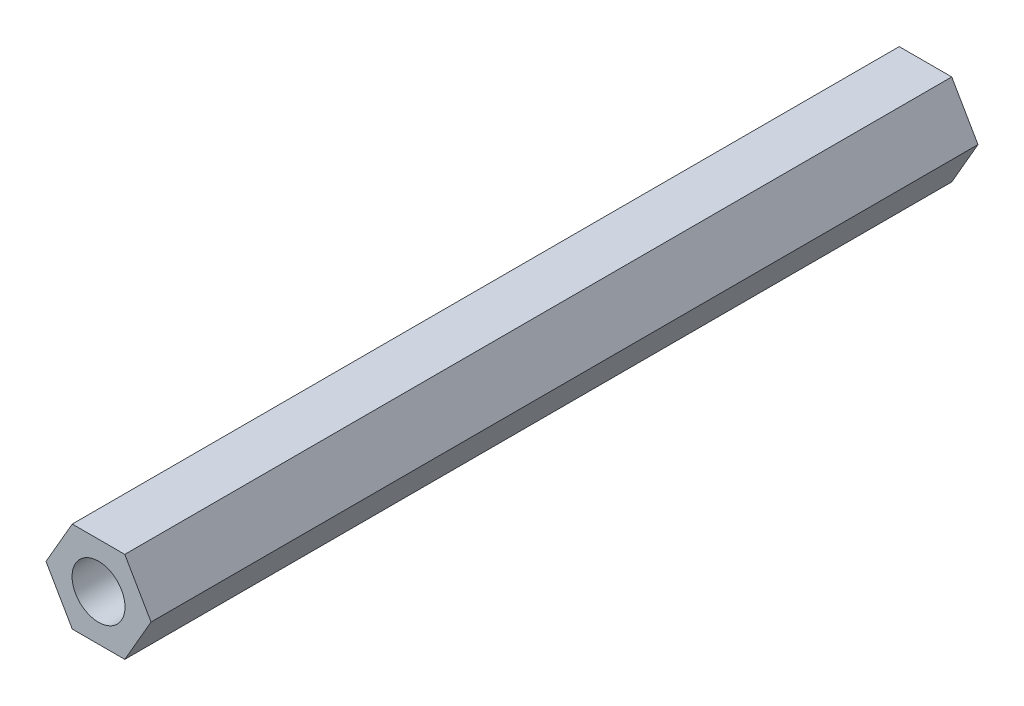
ISO-10303-21;
HEADER;
FILE_DESCRIPTION(('STEP AP214'),'2;1');
FILE_NAME('part.step','',(''),(''),'','','');
FILE_SCHEMA(('AUTOMOTIVE_DESIGN { 1 0 10303 214 1 1 1 1 }'));
ENDSEC;
DATA;
#1=APPLICATION_CONTEXT('core data for automotive mechanical design processes');
#2=APPLICATION_PROTOCOL_DEFINITION('international standard','automotive_design',2000,#1);
#3=PRODUCT_CONTEXT('',#1,'mechanical');
#4=PRODUCT('Part','Part','',(#3));
#5=PRODUCT_RELATED_PRODUCT_CATEGORY('part','',(#4));
#6=PRODUCT_DEFINITION_FORMATION('','',#4);
#7=PRODUCT_DEFINITION_CONTEXT('part definition',#1,'design');
#8=PRODUCT_DEFINITION('design','',#6,#7);
#9=PRODUCT_DEFINITION_SHAPE('','',#8);
#10=(LENGTH_UNIT() NAMED_UNIT(*) SI_UNIT(.MILLI.,.METRE.));
#11=(NAMED_UNIT(*) PLANE_ANGLE_UNIT() SI_UNIT($,.RADIAN.));
#12=(NAMED_UNIT(*) SI_UNIT($,.STERADIAN.) SOLID_ANGLE_UNIT());
#13=UNCERTAINTY_MEASURE_WITH_UNIT(LENGTH_MEASURE(1.E-05),#10,'distance_accuracy_value','');
#14=(GEOMETRIC_REPRESENTATION_CONTEXT(3) GLOBAL_UNCERTAINTY_ASSIGNED_CONTEXT((#13)) GLOBAL_UNIT_ASSIGNED_CONTEXT((#10,
#11,#12)) REPRESENTATION_CONTEXT('',''));
#15=CARTESIAN_POINT('',(0.,0.,0.));
#16=DIRECTION('',(0.,0.,1.));
#17=DIRECTION('',(1.,0.,0.));
#18=AXIS2_PLACEMENT_3D('',#15,#16,#17);
#19=CARTESIAN_POINT('',(0.,0.,50.));
#20=DIRECTION('',(0.,0.,-1.));
#21=DIRECTION('',(-1.,0.,0.));
#22=AXIS2_PLACEMENT_3D('',#19,#20,#21);
#23=PLANE('',#22);
#24=DIRECTION('',(-0.5,-0.866025403784439,0.));
#25=VECTOR('',#24,1.);
#26=CARTESIAN_POINT('',(-3.17542648054294,0.,50.));
#27=LINE('',#26,#25);
#28=CARTESIAN_POINT('',(-1.58771324027147,2.75,50.));
#29=VERTEX_POINT('',#28);
#30=CARTESIAN_POINT('',(-3.17542648054294,0.,50.));
#31=VERTEX_POINT('',#30);
#32=EDGE_CURVE('E129',#29,#31,#27,.T.);
#33=ORIENTED_EDGE('',*,*,#32,.T.);
#34=DIRECTION('',(0.5,-0.866025403784439,0.));
#35=VECTOR('',#34,1.);
#36=CARTESIAN_POINT('',(-1.58771324027147,-2.75,50.));
#37=LINE('',#36,#35);
#38=CARTESIAN_POINT('',(-1.58771324027147,-2.75,50.));
#39=VERTEX_POINT('',#38);
#40=EDGE_CURVE('E87',#31,#39,#37,.T.);
#41=ORIENTED_EDGE('',*,*,#40,.T.);
#42=DIRECTION('',(1.,0.,0.));
#43=VECTOR('',#42,1.);
#44=CARTESIAN_POINT('',(1.58771324027147,-2.75,50.));
#45=LINE('',#44,#43);
#46=CARTESIAN_POINT('',(1.58771324027147,-2.75,50.));
#47=VERTEX_POINT('',#46);
#48=EDGE_CURVE('E100',#39,#47,#45,.T.);
#49=ORIENTED_EDGE('',*,*,#48,.T.);
#50=DIRECTION('',(0.5,0.866025403784439,0.));
#51=VECTOR('',#50,1.);
#52=CARTESIAN_POINT('',(3.17542648054294,0.,50.));
#53=LINE('',#52,#51);
#54=CARTESIAN_POINT('',(3.17542648054294,0.,50.));
#55=VERTEX_POINT('',#54);
#56=EDGE_CURVE('E94',#47,#55,#53,.T.);
#57=ORIENTED_EDGE('',*,*,#56,.T.);
#58=DIRECTION('',(-0.5,0.866025403784439,0.));
#59=VECTOR('',#58,1.);
#60=CARTESIAN_POINT('',(1.58771324027147,2.75,50.));
#61=LINE('',#60,#59);
#62=CARTESIAN_POINT('',(1.58771324027147,2.75,50.));
#63=VERTEX_POINT('',#62);
#64=EDGE_CURVE('E98',#55,#63,#61,.T.);
#65=ORIENTED_EDGE('',*,*,#64,.T.);
#66=DIRECTION('',(-1.,0.,0.));
#67=VECTOR('',#66,1.);
#68=CARTESIAN_POINT('',(-1.58771324027147,2.75,50.));
#69=LINE('',#68,#67);
#70=EDGE_CURVE('E50',#63,#29,#69,.T.);
#71=ORIENTED_EDGE('',*,*,#70,.T.);
#72=EDGE_LOOP('',(#33,#41,#49,#57,#65,#71));
#73=FACE_BOUND('',#72,.T.);
#74=CARTESIAN_POINT('',(0.,0.,50.));
#75=DIRECTION('',(0.,0.,1.));
#76=DIRECTION('',(1.,0.,0.));
#77=AXIS2_PLACEMENT_3D('',#74,#75,#76);
#78=CIRCLE('',#77,1.6);
#79=CARTESIAN_POINT('',(1.6,0.,50.));
#80=VERTEX_POINT('',#79);
#81=EDGE_CURVE('E122',#80,#80,#78,.T.);
#82=ORIENTED_EDGE('',*,*,#81,.F.);
#83=EDGE_LOOP('',(#82));
#84=FACE_BOUND('',#83,.T.);
#85=ADVANCED_FACE('F33',(#73,#84),#23,.F.);
#86=CARTESIAN_POINT('',(0.,0.,0.));
#87=DIRECTION('',(0.,0.,-1.));
#88=DIRECTION('',(-1.,0.,0.));
#89=AXIS2_PLACEMENT_3D('',#86,#87,#88);
#90=PLANE('',#89);
#91=DIRECTION('',(-0.5,-0.866025403784439,0.));
#92=VECTOR('',#91,1.);
#93=CARTESIAN_POINT('',(-3.17542648054294,0.,0.));
#94=LINE('',#93,#92);
#95=CARTESIAN_POINT('',(-1.58771324027147,2.75,0.));
#96=VERTEX_POINT('',#95);
#97=CARTESIAN_POINT('',(-3.17542648054294,0.,0.));
#98=VERTEX_POINT('',#97);
#99=EDGE_CURVE('E118',#96,#98,#94,.T.);
#100=ORIENTED_EDGE('',*,*,#99,.F.);
#101=DIRECTION('',(-1.,0.,0.));
#102=VECTOR('',#101,1.);
#103=CARTESIAN_POINT('',(-1.58771324027147,2.75,0.));
#104=LINE('',#103,#102);
#105=CARTESIAN_POINT('',(1.58771324027147,2.75,0.));
#106=VERTEX_POINT('',#105);
#107=EDGE_CURVE('E79',#106,#96,#104,.T.);
#108=ORIENTED_EDGE('',*,*,#107,.F.);
#109=DIRECTION('',(-0.5,0.866025403784439,0.));
#110=VECTOR('',#109,1.);
#111=CARTESIAN_POINT('',(1.58771324027147,2.75,0.));
#112=LINE('',#111,#110);
#113=CARTESIAN_POINT('',(3.17542648054294,0.,0.));
#114=VERTEX_POINT('',#113);
#115=EDGE_CURVE('E73',#114,#106,#112,.T.);
#116=ORIENTED_EDGE('',*,*,#115,.F.);
#117=DIRECTION('',(0.5,0.866025403784439,0.));
#118=VECTOR('',#117,1.);
#119=CARTESIAN_POINT('',(3.17542648054294,0.,0.));
#120=LINE('',#119,#118);
#121=CARTESIAN_POINT('',(1.58771324027147,-2.75,0.));
#122=VERTEX_POINT('',#121);
#123=EDGE_CURVE('E108',#122,#114,#120,.T.);
#124=ORIENTED_EDGE('',*,*,#123,.F.);
#125=DIRECTION('',(1.,0.,0.));
#126=VECTOR('',#125,1.);
#127=CARTESIAN_POINT('',(1.58771324027147,-2.75,0.));
#128=LINE('',#127,#126);
#129=CARTESIAN_POINT('',(-1.58771324027147,-2.75,0.));
#130=VERTEX_POINT('',#129);
#131=EDGE_CURVE('E124',#130,#122,#128,.T.);
#132=ORIENTED_EDGE('',*,*,#131,.F.);
#133=DIRECTION('',(0.5,-0.866025403784439,0.));
#134=VECTOR('',#133,1.);
#135=CARTESIAN_POINT('',(-1.58771324027147,-2.75,0.));
#136=LINE('',#135,#134);
#137=EDGE_CURVE('E121',#98,#130,#136,.T.);
#138=ORIENTED_EDGE('',*,*,#137,.F.);
#139=EDGE_LOOP('',(#100,#108,#116,#124,#132,#138));
#140=FACE_BOUND('',#139,.T.);
#141=CARTESIAN_POINT('',(0.,0.,0.));
#142=DIRECTION('',(0.,0.,1.));
#143=DIRECTION('',(1.,0.,0.));
#144=AXIS2_PLACEMENT_3D('',#141,#142,#143);
#145=CIRCLE('',#144,1.6);
#146=CARTESIAN_POINT('',(1.6,0.,0.));
#147=VERTEX_POINT('',#146);
#148=EDGE_CURVE('E222',#147,#147,#145,.T.);
#149=ORIENTED_EDGE('',*,*,#148,.T.);
#150=EDGE_LOOP('',(#149));
#151=FACE_BOUND('',#150,.T.);
#152=ADVANCED_FACE('F138',(#140,#151),#90,.T.);
#153=CARTESIAN_POINT('',(-3.17542648054294,0.,50.));
#154=DIRECTION('',(0.866025403784439,-0.5,0.));
#155=DIRECTION('',(0.5,0.866025403784439,0.));
#156=AXIS2_PLACEMENT_3D('',#153,#154,#155);
#157=PLANE('',#156);
#158=ORIENTED_EDGE('',*,*,#99,.T.);
#159=DIRECTION('',(0.,0.,-1.));
#160=VECTOR('',#159,1.);
#161=CARTESIAN_POINT('',(-3.17542648054294,0.,50.));
#162=LINE('',#161,#160);
#163=EDGE_CURVE('E11',#31,#98,#162,.T.);
#164=ORIENTED_EDGE('',*,*,#163,.F.);
#165=ORIENTED_EDGE('',*,*,#32,.F.);
#166=DIRECTION('',(0.,0.,-1.));
#167=VECTOR('',#166,1.);
#168=CARTESIAN_POINT('',(-1.58771324027147,2.75,50.));
#169=LINE('',#168,#167);
#170=EDGE_CURVE('E114',#29,#96,#169,.T.);
#171=ORIENTED_EDGE('',*,*,#170,.T.);
#172=EDGE_LOOP('',(#158,#164,#165,#171));
#173=FACE_BOUND('',#172,.T.);
#174=ADVANCED_FACE('F35',(#173),#157,.F.);
#175=CARTESIAN_POINT('',(-1.58771324027147,-2.75,50.));
#176=DIRECTION('',(0.866025403784439,0.5,0.));
#177=DIRECTION('',(-0.5,0.866025403784439,0.));
#178=AXIS2_PLACEMENT_3D('',#175,#176,#177);
#179=PLANE('',#178);
#180=ORIENTED_EDGE('',*,*,#137,.T.);
#181=DIRECTION('',(0.,0.,-1.));
#182=VECTOR('',#181,1.);
#183=CARTESIAN_POINT('',(-1.58771324027147,-2.75,50.));
#184=LINE('',#183,#182);
#185=EDGE_CURVE('E42',#39,#130,#184,.T.);
#186=ORIENTED_EDGE('',*,*,#185,.F.);
#187=ORIENTED_EDGE('',*,*,#40,.F.);
#188=ORIENTED_EDGE('',*,*,#163,.T.);
#189=EDGE_LOOP('',(#180,#186,#187,#188));
#190=FACE_BOUND('',#189,.T.);
#191=ADVANCED_FACE('F163',(#190),#179,.F.);
#192=CARTESIAN_POINT('',(1.58771324027147,-2.75,50.));
#193=DIRECTION('',(0.,1.,0.));
#194=DIRECTION('',(0.,0.,1.));
#195=AXIS2_PLACEMENT_3D('',#192,#193,#194);
#196=PLANE('',#195);
#197=ORIENTED_EDGE('',*,*,#131,.T.);
#198=DIRECTION('',(0.,0.,-1.));
#199=VECTOR('',#198,1.);
#200=CARTESIAN_POINT('',(1.58771324027147,-2.75,50.));
#201=LINE('',#200,#199);
#202=EDGE_CURVE('E109',#47,#122,#201,.T.);
#203=ORIENTED_EDGE('',*,*,#202,.F.);
#204=ORIENTED_EDGE('',*,*,#48,.F.);
#205=ORIENTED_EDGE('',*,*,#185,.T.);
#206=EDGE_LOOP('',(#197,#203,#204,#205));
#207=FACE_BOUND('',#206,.T.);
#208=ADVANCED_FACE('F135',(#207),#196,.F.);
#209=CARTESIAN_POINT('',(3.17542648054294,0.,50.));
#210=DIRECTION('',(-0.866025403784439,0.5,0.));
#211=DIRECTION('',(-0.5,-0.866025403784439,0.));
#212=AXIS2_PLACEMENT_3D('',#209,#210,#211);
#213=PLANE('',#212);
#214=ORIENTED_EDGE('',*,*,#123,.T.);
#215=DIRECTION('',(0.,0.,-1.));
#216=VECTOR('',#215,1.);
#217=CARTESIAN_POINT('',(3.17542648054294,0.,50.));
#218=LINE('',#217,#216);
#219=EDGE_CURVE('E105',#55,#114,#218,.T.);
#220=ORIENTED_EDGE('',*,*,#219,.F.);
#221=ORIENTED_EDGE('',*,*,#56,.F.);
#222=ORIENTED_EDGE('',*,*,#202,.T.);
#223=EDGE_LOOP('',(#214,#220,#221,#222));
#224=FACE_BOUND('',#223,.T.);
#225=ADVANCED_FACE('F106',(#224),#213,.F.);
#226=CARTESIAN_POINT('',(1.58771324027147,2.75,50.));
#227=DIRECTION('',(-0.866025403784439,-0.5,0.));
#228=DIRECTION('',(0.5,-0.866025403784439,0.));
#229=AXIS2_PLACEMENT_3D('',#226,#227,#228);
#230=PLANE('',#229);
#231=ORIENTED_EDGE('',*,*,#115,.T.);
#232=DIRECTION('',(0.,0.,-1.));
#233=VECTOR('',#232,1.);
#234=CARTESIAN_POINT('',(1.58771324027147,2.75,50.));
#235=LINE('',#234,#233);
#236=EDGE_CURVE('E110',#63,#106,#235,.T.);
#237=ORIENTED_EDGE('',*,*,#236,.F.);
#238=ORIENTED_EDGE('',*,*,#64,.F.);
#239=ORIENTED_EDGE('',*,*,#219,.T.);
#240=EDGE_LOOP('',(#231,#237,#238,#239));
#241=FACE_BOUND('',#240,.T.);
#242=ADVANCED_FACE('F112',(#241),#230,.F.);
#243=CARTESIAN_POINT('',(-1.58771324027147,2.75,50.));
#244=DIRECTION('',(0.,-1.,0.));
#245=DIRECTION('',(0.,0.,-1.));
#246=AXIS2_PLACEMENT_3D('',#243,#244,#245);
#247=PLANE('',#246);
#248=ORIENTED_EDGE('',*,*,#107,.T.);
#249=ORIENTED_EDGE('',*,*,#170,.F.);
#250=ORIENTED_EDGE('',*,*,#70,.F.);
#251=ORIENTED_EDGE('',*,*,#236,.T.);
#252=EDGE_LOOP('',(#248,#249,#250,#251));
#253=FACE_BOUND('',#252,.T.);
#254=ADVANCED_FACE('F143',(#253),#247,.F.);
#255=CARTESIAN_POINT('',(0.,0.,50.));
#256=DIRECTION('',(0.,0.,-1.));
#257=DIRECTION('',(-1.,0.,0.));
#258=AXIS2_PLACEMENT_3D('',#255,#256,#257);
#259=CYLINDRICAL_SURFACE('',#258,1.6);
#260=ORIENTED_EDGE('',*,*,#81,.T.);
#261=EDGE_LOOP('',(#260));
#262=FACE_BOUND('',#261,.T.);
#263=ORIENTED_EDGE('',*,*,#148,.F.);
#264=EDGE_LOOP('',(#263));
#265=FACE_BOUND('',#264,.T.);
#266=ADVANCED_FACE('F145',(#262,#265),#259,.F.);
#267=CLOSED_SHELL('',(#85,#152,#174,#191,#208,#225,#242,#254,#266));
#268=MANIFOLD_SOLID_BREP('B2',#267);
#269=ADVANCED_BREP_SHAPE_REPRESENTATION('',(#18,#268),#14);
#270=SHAPE_DEFINITION_REPRESENTATION(#9,#269);
ENDSEC;
END-ISO-10303-21;
